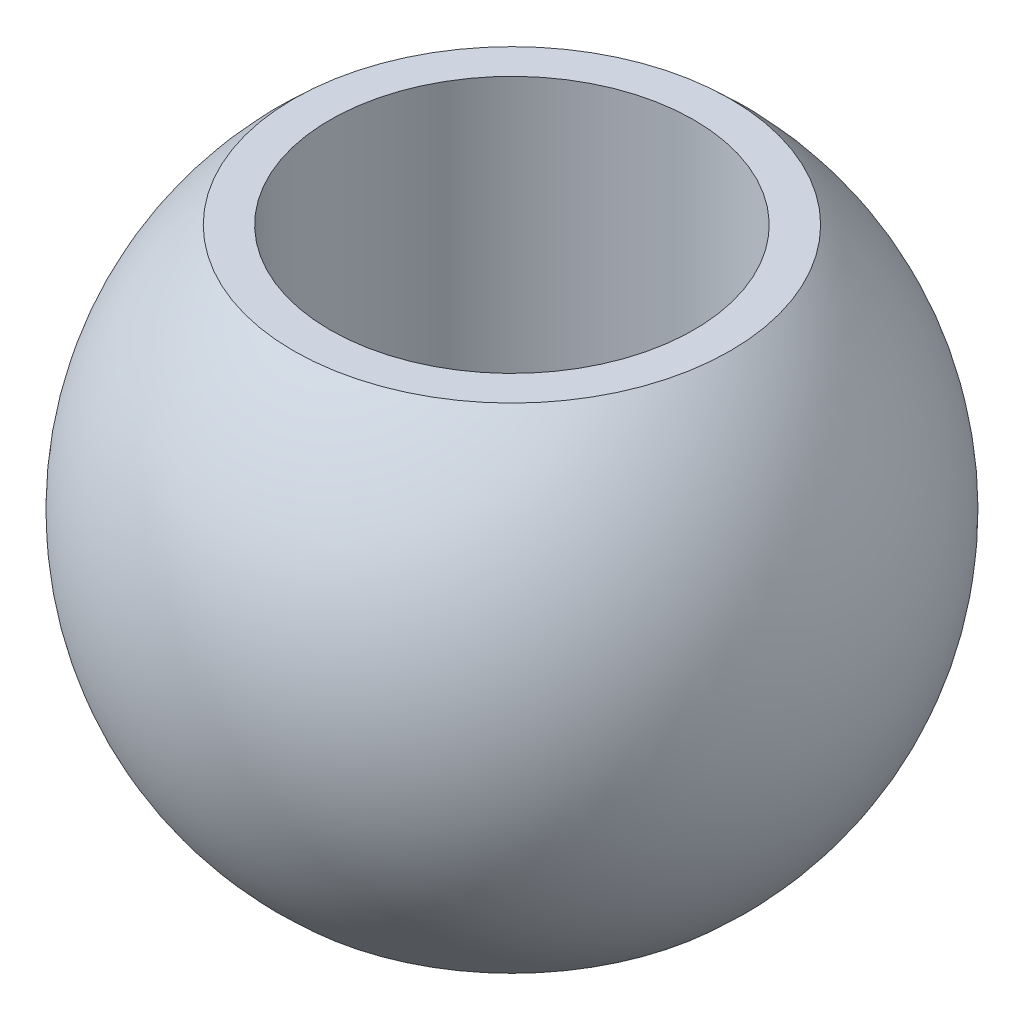
ISO-10303-21;
HEADER;
FILE_DESCRIPTION(('STEP AP214'),'2;1');
FILE_NAME('part.step','',(''),(''),'','','');
FILE_SCHEMA(('AUTOMOTIVE_DESIGN { 1 0 10303 214 1 1 1 1 }'));
ENDSEC;
DATA;
#1=APPLICATION_CONTEXT('core data for automotive mechanical design processes');
#2=APPLICATION_PROTOCOL_DEFINITION('international standard','automotive_design',2000,#1);
#3=PRODUCT_CONTEXT('',#1,'mechanical');
#4=PRODUCT('Part','Part','',(#3));
#5=PRODUCT_RELATED_PRODUCT_CATEGORY('part','',(#4));
#6=PRODUCT_DEFINITION_FORMATION('','',#4);
#7=PRODUCT_DEFINITION_CONTEXT('part definition',#1,'design');
#8=PRODUCT_DEFINITION('design','',#6,#7);
#9=PRODUCT_DEFINITION_SHAPE('','',#8);
#10=(LENGTH_UNIT() NAMED_UNIT(*) SI_UNIT(.MILLI.,.METRE.));
#11=(NAMED_UNIT(*) PLANE_ANGLE_UNIT() SI_UNIT($,.RADIAN.));
#12=(NAMED_UNIT(*) SI_UNIT($,.STERADIAN.) SOLID_ANGLE_UNIT());
#13=UNCERTAINTY_MEASURE_WITH_UNIT(LENGTH_MEASURE(1.E-05),#10,'distance_accuracy_value','');
#14=(GEOMETRIC_REPRESENTATION_CONTEXT(3) GLOBAL_UNCERTAINTY_ASSIGNED_CONTEXT((#13)) GLOBAL_UNIT_ASSIGNED_CONTEXT((#10,
#11,#12)) REPRESENTATION_CONTEXT('',''));
#15=CARTESIAN_POINT('',(0.,0.,0.));
#16=DIRECTION('',(0.,0.,1.));
#17=DIRECTION('',(1.,0.,0.));
#18=AXIS2_PLACEMENT_3D('',#15,#16,#17);
#19=CARTESIAN_POINT('',(7.,-9.5,0.));
#20=DIRECTION('',(0.,-1.,0.));
#21=DIRECTION('',(0.,0.,-1.));
#22=AXIS2_PLACEMENT_3D('',#19,#20,#21);
#23=PLANE('',#22);
#24=CARTESIAN_POINT('',(0.,-9.5,0.));
#25=DIRECTION('',(0.,-1.,0.));
#26=DIRECTION('',(0.,0.,-1.));
#27=AXIS2_PLACEMENT_3D('',#24,#25,#26);
#28=CIRCLE('',#27,8.39835698217216);
#29=CARTESIAN_POINT('',(0.,-9.5,-8.39835698217216));
#30=VERTEX_POINT('',#29);
#31=EDGE_CURVE('E10',#30,#30,#28,.T.);
#32=ORIENTED_EDGE('',*,*,#31,.T.);
#33=EDGE_LOOP('',(#32));
#34=FACE_BOUND('',#33,.T.);
#35=CARTESIAN_POINT('',(0.,-9.5,0.));
#36=DIRECTION('',(0.,-1.,0.));
#37=DIRECTION('',(0.,0.,-1.));
#38=AXIS2_PLACEMENT_3D('',#35,#36,#37);
#39=CIRCLE('',#38,7.);
#40=CARTESIAN_POINT('',(0.,-9.5,-7.));
#41=VERTEX_POINT('',#40);
#42=EDGE_CURVE('E45',#41,#41,#39,.T.);
#43=ORIENTED_EDGE('',*,*,#42,.F.);
#44=EDGE_LOOP('',(#43));
#45=FACE_BOUND('',#44,.T.);
#46=ADVANCED_FACE('F31',(#34,#45),#23,.T.);
#47=CARTESIAN_POINT('',(0.,0.,0.));
#48=DIRECTION('',(0.,-1.,0.));
#49=DIRECTION('',(1.,0.,0.));
#50=AXIS2_PLACEMENT_3D('',#47,#48,#49);
#51=SPHERICAL_SURFACE('',#50,12.68);
#52=CARTESIAN_POINT('',(0.,9.5,0.));
#53=DIRECTION('',(0.,-1.,0.));
#54=DIRECTION('',(0.,0.,-1.));
#55=AXIS2_PLACEMENT_3D('',#52,#53,#54);
#56=CIRCLE('',#55,8.39835698217217);
#57=CARTESIAN_POINT('',(0.,9.5,-8.39835698217217));
#58=VERTEX_POINT('',#57);
#59=EDGE_CURVE('E37',#58,#58,#56,.T.);
#60=ORIENTED_EDGE('',*,*,#59,.T.);
#61=EDGE_LOOP('',(#60));
#62=FACE_BOUND('',#61,.T.);
#63=ORIENTED_EDGE('',*,*,#31,.F.);
#64=EDGE_LOOP('',(#63));
#65=FACE_BOUND('',#64,.T.);
#66=ADVANCED_FACE('F55',(#62,#65),#51,.T.);
#67=CARTESIAN_POINT('',(7.,9.5,0.));
#68=DIRECTION('',(0.,1.,0.));
#69=DIRECTION('',(0.,0.,1.));
#70=AXIS2_PLACEMENT_3D('',#67,#68,#69);
#71=PLANE('',#70);
#72=CARTESIAN_POINT('',(0.,9.5,0.));
#73=DIRECTION('',(0.,-1.,0.));
#74=DIRECTION('',(0.,0.,-1.));
#75=AXIS2_PLACEMENT_3D('',#72,#73,#74);
#76=CIRCLE('',#75,7.);
#77=CARTESIAN_POINT('',(0.,9.5,-7.));
#78=VERTEX_POINT('',#77);
#79=EDGE_CURVE('E41',#78,#78,#76,.T.);
#80=ORIENTED_EDGE('',*,*,#79,.T.);
#81=EDGE_LOOP('',(#80));
#82=FACE_BOUND('',#81,.T.);
#83=ORIENTED_EDGE('',*,*,#59,.F.);
#84=EDGE_LOOP('',(#83));
#85=FACE_BOUND('',#84,.T.);
#86=ADVANCED_FACE('F59',(#82,#85),#71,.T.);
#87=CARTESIAN_POINT('',(0.,-11.1,0.));
#88=DIRECTION('',(0.,-1.,0.));
#89=DIRECTION('',(0.,0.,-1.));
#90=AXIS2_PLACEMENT_3D('',#87,#88,#89);
#91=CYLINDRICAL_SURFACE('',#90,7.);
#92=ORIENTED_EDGE('',*,*,#42,.T.);
#93=EDGE_LOOP('',(#92));
#94=FACE_BOUND('',#93,.T.);
#95=ORIENTED_EDGE('',*,*,#79,.F.);
#96=EDGE_LOOP('',(#95));
#97=FACE_BOUND('',#96,.T.);
#98=ADVANCED_FACE('F51',(#94,#97),#91,.F.);
#99=CLOSED_SHELL('',(#46,#66,#86,#98));
#100=MANIFOLD_SOLID_BREP('B2',#99);
#101=ADVANCED_BREP_SHAPE_REPRESENTATION('',(#18,#100),#14);
#102=SHAPE_DEFINITION_REPRESENTATION(#9,#101);
ENDSEC;
END-ISO-10303-21;
